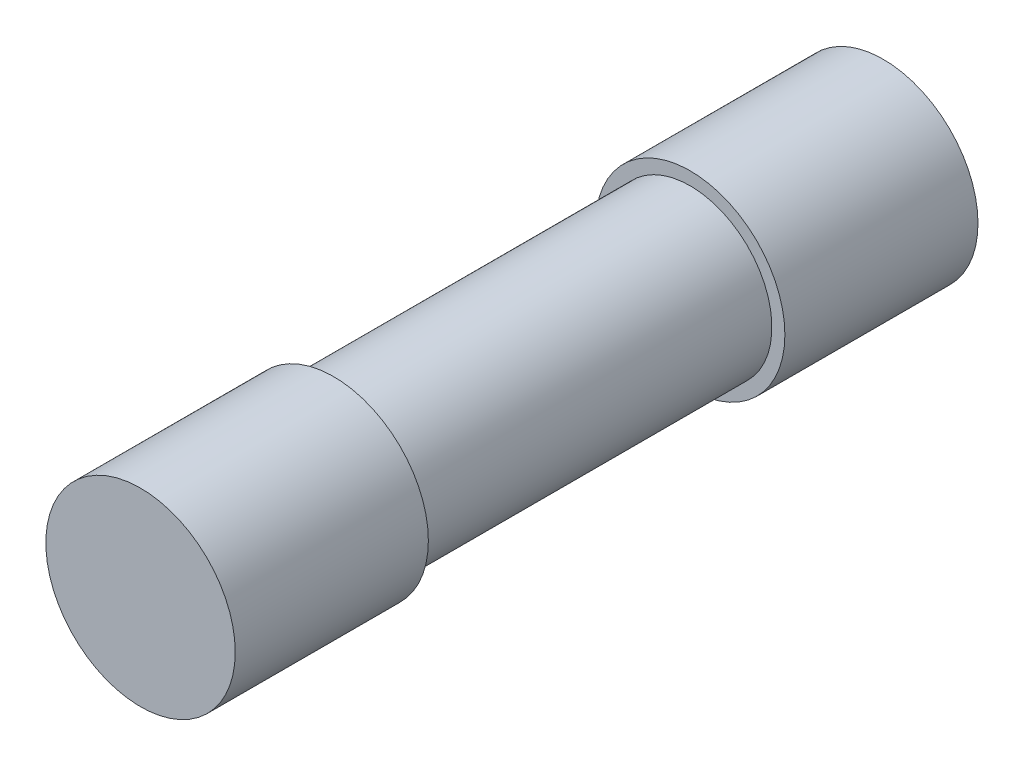
ISO-10303-21;
HEADER;
FILE_DESCRIPTION(('STEP AP214'),'2;1');
FILE_NAME('part.step','',(''),(''),'','','');
FILE_SCHEMA(('AUTOMOTIVE_DESIGN { 1 0 10303 214 1 1 1 1 }'));
ENDSEC;
DATA;
#1=APPLICATION_CONTEXT('core data for automotive mechanical design processes');
#2=APPLICATION_PROTOCOL_DEFINITION('international standard','automotive_design',2000,#1);
#3=PRODUCT_CONTEXT('',#1,'mechanical');
#4=PRODUCT('Part','Part','',(#3));
#5=PRODUCT_RELATED_PRODUCT_CATEGORY('part','',(#4));
#6=PRODUCT_DEFINITION_FORMATION('','',#4);
#7=PRODUCT_DEFINITION_CONTEXT('part definition',#1,'design');
#8=PRODUCT_DEFINITION('design','',#6,#7);
#9=PRODUCT_DEFINITION_SHAPE('','',#8);
#10=(LENGTH_UNIT() NAMED_UNIT(*) SI_UNIT(.MILLI.,.METRE.));
#11=(NAMED_UNIT(*) PLANE_ANGLE_UNIT() SI_UNIT($,.RADIAN.));
#12=(NAMED_UNIT(*) SI_UNIT($,.STERADIAN.) SOLID_ANGLE_UNIT());
#13=UNCERTAINTY_MEASURE_WITH_UNIT(LENGTH_MEASURE(1.E-05),#10,'distance_accuracy_value','');
#14=(GEOMETRIC_REPRESENTATION_CONTEXT(3) GLOBAL_UNCERTAINTY_ASSIGNED_CONTEXT((#13)) GLOBAL_UNIT_ASSIGNED_CONTEXT((#10,
#11,#12)) REPRESENTATION_CONTEXT('',''));
#15=CARTESIAN_POINT('',(0.,0.,0.));
#16=DIRECTION('',(0.,0.,1.));
#17=DIRECTION('',(1.,0.,0.));
#18=AXIS2_PLACEMENT_3D('',#15,#16,#17);
#19=CARTESIAN_POINT('',(0.,0.,-10.));
#20=DIRECTION('',(0.,0.,-1.));
#21=DIRECTION('',(-1.,0.,0.));
#22=AXIS2_PLACEMENT_3D('',#19,#20,#21);
#23=PLANE('',#22);
#24=CARTESIAN_POINT('',(0.,0.,-10.));
#25=DIRECTION('',(0.,0.,1.));
#26=DIRECTION('',(1.,0.,0.));
#27=AXIS2_PLACEMENT_3D('',#24,#25,#26);
#28=CIRCLE('',#27,2.55);
#29=CARTESIAN_POINT('',(2.55,0.,-10.));
#30=VERTEX_POINT('',#29);
#31=EDGE_CURVE('E17',#30,#30,#28,.T.);
#32=ORIENTED_EDGE('',*,*,#31,.F.);
#33=EDGE_LOOP('',(#32));
#34=FACE_BOUND('',#33,.T.);
#35=ADVANCED_FACE('F14',(#34),#23,.T.);
#36=CARTESIAN_POINT('',(0.,0.,10.));
#37=DIRECTION('',(0.,0.,-1.));
#38=DIRECTION('',(-1.,0.,0.));
#39=AXIS2_PLACEMENT_3D('',#36,#37,#38);
#40=PLANE('',#39);
#41=CARTESIAN_POINT('',(0.,0.,10.));
#42=DIRECTION('',(0.,0.,1.));
#43=DIRECTION('',(1.,0.,0.));
#44=AXIS2_PLACEMENT_3D('',#41,#42,#43);
#45=CIRCLE('',#44,2.55);
#46=CARTESIAN_POINT('',(2.55,0.,10.));
#47=VERTEX_POINT('',#46);
#48=EDGE_CURVE('E33',#47,#47,#45,.F.);
#49=ORIENTED_EDGE('',*,*,#48,.F.);
#50=EDGE_LOOP('',(#49));
#51=FACE_BOUND('',#50,.T.);
#52=ADVANCED_FACE('F43',(#51),#40,.F.);
#53=CARTESIAN_POINT('',(0.,0.,0.));
#54=DIRECTION('',(0.,0.,1.));
#55=DIRECTION('',(1.,0.,0.));
#56=AXIS2_PLACEMENT_3D('',#53,#54,#55);
#57=CYLINDRICAL_SURFACE('',#56,2.55);
#58=CARTESIAN_POINT('',(0.,0.,-4.8));
#59=DIRECTION('',(0.,0.,1.));
#60=DIRECTION('',(1.,0.,0.));
#61=AXIS2_PLACEMENT_3D('',#58,#59,#60);
#62=CIRCLE('',#61,2.55);
#63=CARTESIAN_POINT('',(2.55,0.,-4.8));
#64=VERTEX_POINT('',#63);
#65=EDGE_CURVE('E31',#64,#64,#62,.F.);
#66=ORIENTED_EDGE('',*,*,#65,.T.);
#67=EDGE_LOOP('',(#66));
#68=FACE_BOUND('',#67,.T.);
#69=ORIENTED_EDGE('',*,*,#31,.T.);
#70=EDGE_LOOP('',(#69));
#71=FACE_BOUND('',#70,.T.);
#72=ADVANCED_FACE('F40',(#68,#71),#57,.T.);
#73=CARTESIAN_POINT('',(0.,0.,0.));
#74=DIRECTION('',(0.,0.,1.));
#75=DIRECTION('',(1.,0.,0.));
#76=AXIS2_PLACEMENT_3D('',#73,#74,#75);
#77=CYLINDRICAL_SURFACE('',#76,2.55);
#78=ORIENTED_EDGE('',*,*,#48,.T.);
#79=EDGE_LOOP('',(#78));
#80=FACE_BOUND('',#79,.T.);
#81=CARTESIAN_POINT('',(0.,0.,4.8));
#82=DIRECTION('',(0.,0.,1.));
#83=DIRECTION('',(1.,0.,0.));
#84=AXIS2_PLACEMENT_3D('',#81,#82,#83);
#85=CIRCLE('',#84,2.55);
#86=CARTESIAN_POINT('',(2.55,0.,4.8));
#87=VERTEX_POINT('',#86);
#88=EDGE_CURVE('E26',#87,#87,#85,.F.);
#89=ORIENTED_EDGE('',*,*,#88,.F.);
#90=EDGE_LOOP('',(#89));
#91=FACE_BOUND('',#90,.T.);
#92=ADVANCED_FACE('F64',(#80,#91),#77,.T.);
#93=CARTESIAN_POINT('',(0.,0.,-4.8));
#94=DIRECTION('',(0.,0.,-1.));
#95=DIRECTION('',(-1.,0.,0.));
#96=AXIS2_PLACEMENT_3D('',#93,#94,#95);
#97=PLANE('',#96);
#98=CARTESIAN_POINT('',(0.,0.,-4.80000000075));
#99=DIRECTION('',(0.,0.,-1.));
#100=DIRECTION('',(-1.,0.,0.));
#101=AXIS2_PLACEMENT_3D('',#98,#99,#100);
#102=CIRCLE('',#101,2.2);
#103=CARTESIAN_POINT('',(-2.2,0.,-4.80000000075));
#104=VERTEX_POINT('',#103);
#105=EDGE_CURVE('E21',#104,#104,#102,.F.);
#106=ORIENTED_EDGE('',*,*,#105,.F.);
#107=EDGE_LOOP('',(#106));
#108=FACE_BOUND('',#107,.T.);
#109=ORIENTED_EDGE('',*,*,#65,.F.);
#110=EDGE_LOOP('',(#109));
#111=FACE_BOUND('',#110,.T.);
#112=ADVANCED_FACE('F58',(#108,#111),#97,.F.);
#113=CARTESIAN_POINT('',(0.,0.,4.8));
#114=DIRECTION('',(0.,0.,-1.));
#115=DIRECTION('',(-1.,0.,0.));
#116=AXIS2_PLACEMENT_3D('',#113,#114,#115);
#117=PLANE('',#116);
#118=CARTESIAN_POINT('',(0.,0.,4.80000000075));
#119=DIRECTION('',(0.,0.,-1.));
#120=DIRECTION('',(-1.,0.,0.));
#121=AXIS2_PLACEMENT_3D('',#118,#119,#120);
#122=CIRCLE('',#121,2.2);
#123=CARTESIAN_POINT('',(-2.2,0.,4.80000000075));
#124=VERTEX_POINT('',#123);
#125=EDGE_CURVE('E10',#124,#124,#122,.T.);
#126=ORIENTED_EDGE('',*,*,#125,.F.);
#127=EDGE_LOOP('',(#126));
#128=FACE_BOUND('',#127,.T.);
#129=ORIENTED_EDGE('',*,*,#88,.T.);
#130=EDGE_LOOP('',(#129));
#131=FACE_BOUND('',#130,.T.);
#132=ADVANCED_FACE('F51',(#128,#131),#117,.T.);
#133=CARTESIAN_POINT('',(0.,0.,0.));
#134=DIRECTION('',(0.,0.,-1.));
#135=DIRECTION('',(-1.,0.,0.));
#136=AXIS2_PLACEMENT_3D('',#133,#134,#135);
#137=CYLINDRICAL_SURFACE('',#136,2.2);
#138=ORIENTED_EDGE('',*,*,#105,.T.);
#139=EDGE_LOOP('',(#138));
#140=FACE_BOUND('',#139,.T.);
#141=ORIENTED_EDGE('',*,*,#125,.T.);
#142=EDGE_LOOP('',(#141));
#143=FACE_BOUND('',#142,.T.);
#144=ADVANCED_FACE('F49',(#140,#143),#137,.T.);
#145=CLOSED_SHELL('',(#35,#52,#72,#92,#112,#132,#144));
#146=MANIFOLD_SOLID_BREP('B1',#145);
#147=ADVANCED_BREP_SHAPE_REPRESENTATION('',(#18,#146),#14);
#148=SHAPE_DEFINITION_REPRESENTATION(#9,#147);
ENDSEC;
END-ISO-10303-21;
